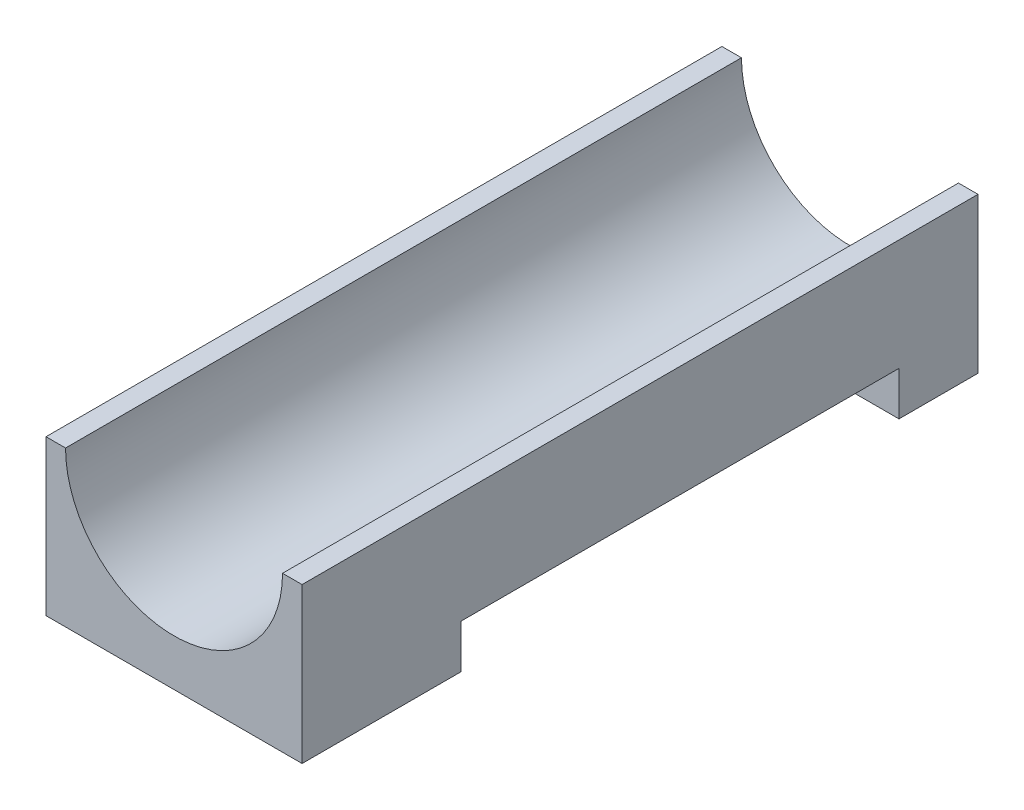
ISO-10303-21;
HEADER;
FILE_DESCRIPTION(('STEP AP214'),'2;1');
FILE_NAME('part.step','',(''),(''),'','','');
FILE_SCHEMA(('AUTOMOTIVE_DESIGN { 1 0 10303 214 1 1 1 1 }'));
ENDSEC;
DATA;
#1=APPLICATION_CONTEXT('core data for automotive mechanical design processes');
#2=APPLICATION_PROTOCOL_DEFINITION('international standard','automotive_design',2000,#1);
#3=PRODUCT_CONTEXT('',#1,'mechanical');
#4=PRODUCT('Part','Part','',(#3));
#5=PRODUCT_RELATED_PRODUCT_CATEGORY('part','',(#4));
#6=PRODUCT_DEFINITION_FORMATION('','',#4);
#7=PRODUCT_DEFINITION_CONTEXT('part definition',#1,'design');
#8=PRODUCT_DEFINITION('design','',#6,#7);
#9=PRODUCT_DEFINITION_SHAPE('','',#8);
#10=(LENGTH_UNIT() NAMED_UNIT(*) SI_UNIT(.MILLI.,.METRE.));
#11=(NAMED_UNIT(*) PLANE_ANGLE_UNIT() SI_UNIT($,.RADIAN.));
#12=(NAMED_UNIT(*) SI_UNIT($,.STERADIAN.) SOLID_ANGLE_UNIT());
#13=UNCERTAINTY_MEASURE_WITH_UNIT(LENGTH_MEASURE(1.E-05),#10,'distance_accuracy_value','');
#14=(GEOMETRIC_REPRESENTATION_CONTEXT(3) GLOBAL_UNCERTAINTY_ASSIGNED_CONTEXT((#13)) GLOBAL_UNIT_ASSIGNED_CONTEXT((#10,
#11,#12)) REPRESENTATION_CONTEXT('',''));
#15=CARTESIAN_POINT('',(0.,0.,0.));
#16=DIRECTION('',(0.,0.,1.));
#17=DIRECTION('',(1.,0.,0.));
#18=AXIS2_PLACEMENT_3D('',#15,#16,#17);
#19=CARTESIAN_POINT('',(0.,23.,100.3));
#20=DIRECTION('',(1.,0.,0.));
#21=DIRECTION('',(0.,1.,0.));
#22=AXIS2_PLACEMENT_3D('',#19,#20,#21);
#23=PLANE('',#22);
#24=DIRECTION('',(0.,1.,0.));
#25=VECTOR('',#24,1.);
#26=CARTESIAN_POINT('',(0.,6.5,11.7250079261373));
#27=LINE('',#26,#25);
#28=CARTESIAN_POINT('',(0.,0.,11.7250079261373));
#29=VERTEX_POINT('',#28);
#30=CARTESIAN_POINT('',(0.,6.5,11.7250079261373));
#31=VERTEX_POINT('',#30);
#32=EDGE_CURVE('E113',#29,#31,#27,.T.);
#33=ORIENTED_EDGE('',*,*,#32,.T.);
#34=DIRECTION('',(0.,0.,1.));
#35=VECTOR('',#34,1.);
#36=CARTESIAN_POINT('',(0.,6.5,76.7250079261373));
#37=LINE('',#36,#35);
#38=CARTESIAN_POINT('',(0.,6.5,76.7250079261373));
#39=VERTEX_POINT('',#38);
#40=EDGE_CURVE('E194',#31,#39,#37,.T.);
#41=ORIENTED_EDGE('',*,*,#40,.T.);
#42=DIRECTION('',(0.,-1.,0.));
#43=VECTOR('',#42,1.);
#44=CARTESIAN_POINT('',(0.,0.,76.7250079261373));
#45=LINE('',#44,#43);
#46=CARTESIAN_POINT('',(0.,0.,76.7250079261373));
#47=VERTEX_POINT('',#46);
#48=EDGE_CURVE('E127',#39,#47,#45,.T.);
#49=ORIENTED_EDGE('',*,*,#48,.T.);
#50=DIRECTION('',(0.,0.,-1.));
#51=VECTOR('',#50,1.);
#52=CARTESIAN_POINT('',(0.,0.,100.3));
#53=LINE('',#52,#51);
#54=CARTESIAN_POINT('',(0.,0.,100.3));
#55=VERTEX_POINT('',#54);
#56=EDGE_CURVE('E40',#55,#47,#53,.T.);
#57=ORIENTED_EDGE('',*,*,#56,.F.);
#58=DIRECTION('',(0.,-1.,0.));
#59=VECTOR('',#58,1.);
#60=CARTESIAN_POINT('',(0.,23.,100.3));
#61=LINE('',#60,#59);
#62=CARTESIAN_POINT('',(0.,23.,100.3));
#63=VERTEX_POINT('',#62);
#64=EDGE_CURVE('E170',#63,#55,#61,.T.);
#65=ORIENTED_EDGE('',*,*,#64,.F.);
#66=DIRECTION('',(0.,0.,-1.));
#67=VECTOR('',#66,1.);
#68=CARTESIAN_POINT('',(0.,23.,100.3));
#69=LINE('',#68,#67);
#70=CARTESIAN_POINT('',(0.,23.,0.));
#71=VERTEX_POINT('',#70);
#72=EDGE_CURVE('E139',#63,#71,#69,.T.);
#73=ORIENTED_EDGE('',*,*,#72,.T.);
#74=DIRECTION('',(0.,-1.,0.));
#75=VECTOR('',#74,1.);
#76=CARTESIAN_POINT('',(0.,23.,0.));
#77=LINE('',#76,#75);
#78=CARTESIAN_POINT('',(0.,0.,0.));
#79=VERTEX_POINT('',#78);
#80=EDGE_CURVE('E152',#71,#79,#77,.T.);
#81=ORIENTED_EDGE('',*,*,#80,.T.);
#82=EDGE_CURVE('E137',#29,#79,#53,.T.);
#83=ORIENTED_EDGE('',*,*,#82,.F.);
#84=EDGE_LOOP('',(#33,#41,#49,#57,#65,#73,#81,#83));
#85=FACE_BOUND('',#84,.T.);
#86=ADVANCED_FACE('F33',(#85),#23,.F.);
#87=CARTESIAN_POINT('',(0.,0.,100.3));
#88=DIRECTION('',(0.,1.,0.));
#89=DIRECTION('',(0.,0.,1.));
#90=AXIS2_PLACEMENT_3D('',#87,#88,#89);
#91=PLANE('',#90);
#92=DIRECTION('',(-1.,0.,0.));
#93=VECTOR('',#92,1.);
#94=CARTESIAN_POINT('',(38.,0.,11.7250079261373));
#95=LINE('',#94,#93);
#96=CARTESIAN_POINT('',(38.,0.,11.7250079261373));
#97=VERTEX_POINT('',#96);
#98=EDGE_CURVE('E107',#97,#29,#95,.T.);
#99=ORIENTED_EDGE('',*,*,#98,.T.);
#100=ORIENTED_EDGE('',*,*,#82,.T.);
#101=DIRECTION('',(1.,0.,0.));
#102=VECTOR('',#101,1.);
#103=CARTESIAN_POINT('',(0.,0.,0.));
#104=LINE('',#103,#102);
#105=CARTESIAN_POINT('',(38.,0.,0.));
#106=VERTEX_POINT('',#105);
#107=EDGE_CURVE('E131',#79,#106,#104,.T.);
#108=ORIENTED_EDGE('',*,*,#107,.T.);
#109=DIRECTION('',(0.,0.,-1.));
#110=VECTOR('',#109,1.);
#111=CARTESIAN_POINT('',(38.,0.,100.3));
#112=LINE('',#111,#110);
#113=EDGE_CURVE('E123',#97,#106,#112,.T.);
#114=ORIENTED_EDGE('',*,*,#113,.F.);
#115=EDGE_LOOP('',(#99,#100,#108,#114));
#116=FACE_BOUND('',#115,.T.);
#117=ADVANCED_FACE('F129',(#116),#91,.F.);
#118=DIRECTION('',(-1.,0.,0.));
#119=VECTOR('',#118,1.);
#120=CARTESIAN_POINT('',(38.,0.,76.7250079261373));
#121=LINE('',#120,#119);
#122=CARTESIAN_POINT('',(38.,0.,76.7250079261373));
#123=VERTEX_POINT('',#122);
#124=EDGE_CURVE('E189',#123,#47,#121,.T.);
#125=ORIENTED_EDGE('',*,*,#124,.F.);
#126=CARTESIAN_POINT('',(38.,0.,100.3));
#127=VERTEX_POINT('',#126);
#128=EDGE_CURVE('E133',#127,#123,#112,.T.);
#129=ORIENTED_EDGE('',*,*,#128,.F.);
#130=DIRECTION('',(1.,0.,0.));
#131=VECTOR('',#130,1.);
#132=CARTESIAN_POINT('',(0.,0.,100.3));
#133=LINE('',#132,#131);
#134=EDGE_CURVE('E179',#55,#127,#133,.T.);
#135=ORIENTED_EDGE('',*,*,#134,.F.);
#136=ORIENTED_EDGE('',*,*,#56,.T.);
#137=EDGE_LOOP('',(#125,#129,#135,#136));
#138=FACE_BOUND('',#137,.T.);
#139=ADVANCED_FACE('F204',(#138),#91,.F.);
#140=CARTESIAN_POINT('',(38.,0.,100.3));
#141=DIRECTION('',(-1.,0.,0.));
#142=DIRECTION('',(0.,0.,1.));
#143=AXIS2_PLACEMENT_3D('',#140,#141,#142);
#144=PLANE('',#143);
#145=DIRECTION('',(0.,1.,0.));
#146=VECTOR('',#145,1.);
#147=CARTESIAN_POINT('',(38.,6.5,11.7250079261373));
#148=LINE('',#147,#146);
#149=CARTESIAN_POINT('',(38.,6.5,11.7250079261373));
#150=VERTEX_POINT('',#149);
#151=EDGE_CURVE('E110',#97,#150,#148,.T.);
#152=ORIENTED_EDGE('',*,*,#151,.F.);
#153=ORIENTED_EDGE('',*,*,#113,.T.);
#154=DIRECTION('',(0.,1.,0.));
#155=VECTOR('',#154,1.);
#156=CARTESIAN_POINT('',(38.,0.,0.));
#157=LINE('',#156,#155);
#158=CARTESIAN_POINT('',(38.,23.,0.));
#159=VERTEX_POINT('',#158);
#160=EDGE_CURVE('E154',#106,#159,#157,.T.);
#161=ORIENTED_EDGE('',*,*,#160,.T.);
#162=DIRECTION('',(0.,0.,-1.));
#163=VECTOR('',#162,1.);
#164=CARTESIAN_POINT('',(38.,23.,100.3));
#165=LINE('',#164,#163);
#166=CARTESIAN_POINT('',(38.,23.,100.3));
#167=VERTEX_POINT('',#166);
#168=EDGE_CURVE('E134',#167,#159,#165,.T.);
#169=ORIENTED_EDGE('',*,*,#168,.F.);
#170=DIRECTION('',(0.,1.,0.));
#171=VECTOR('',#170,1.);
#172=CARTESIAN_POINT('',(38.,0.,100.3));
#173=LINE('',#172,#171);
#174=EDGE_CURVE('E176',#127,#167,#173,.T.);
#175=ORIENTED_EDGE('',*,*,#174,.F.);
#176=ORIENTED_EDGE('',*,*,#128,.T.);
#177=DIRECTION('',(0.,-1.,0.));
#178=VECTOR('',#177,1.);
#179=CARTESIAN_POINT('',(38.,0.,76.7250079261373));
#180=LINE('',#179,#178);
#181=CARTESIAN_POINT('',(38.,6.5,76.7250079261373));
#182=VERTEX_POINT('',#181);
#183=EDGE_CURVE('E191',#182,#123,#180,.T.);
#184=ORIENTED_EDGE('',*,*,#183,.F.);
#185=DIRECTION('',(0.,0.,1.));
#186=VECTOR('',#185,1.);
#187=CARTESIAN_POINT('',(38.,6.5,76.7250079261373));
#188=LINE('',#187,#186);
#189=EDGE_CURVE('E126',#150,#182,#188,.T.);
#190=ORIENTED_EDGE('',*,*,#189,.F.);
#191=EDGE_LOOP('',(#152,#153,#161,#169,#175,#176,#184,#190));
#192=FACE_BOUND('',#191,.T.);
#193=ADVANCED_FACE('F122',(#192),#144,.F.);
#194=CARTESIAN_POINT('',(38.,23.,100.3));
#195=DIRECTION('',(0.,-1.,0.));
#196=DIRECTION('',(1.,0.,0.));
#197=AXIS2_PLACEMENT_3D('',#194,#195,#196);
#198=PLANE('',#197);
#199=DIRECTION('',(0.,0.,-1.));
#200=VECTOR('',#199,1.);
#201=CARTESIAN_POINT('',(2.9,23.,100.3));
#202=LINE('',#201,#200);
#203=CARTESIAN_POINT('',(2.9,23.,0.));
#204=VERTEX_POINT('',#203);
#205=CARTESIAN_POINT('',(2.9,23.,100.3));
#206=VERTEX_POINT('',#205);
#207=EDGE_CURVE('E159',#204,#206,#202,.F.);
#208=ORIENTED_EDGE('',*,*,#207,.F.);
#209=DIRECTION('',(-1.,0.,0.));
#210=VECTOR('',#209,1.);
#211=CARTESIAN_POINT('',(38.,23.,0.));
#212=LINE('',#211,#210);
#213=EDGE_CURVE('E167',#204,#71,#212,.T.);
#214=ORIENTED_EDGE('',*,*,#213,.T.);
#215=ORIENTED_EDGE('',*,*,#72,.F.);
#216=DIRECTION('',(-1.,0.,0.));
#217=VECTOR('',#216,1.);
#218=CARTESIAN_POINT('',(38.,23.,100.3));
#219=LINE('',#218,#217);
#220=EDGE_CURVE('E172',#206,#63,#219,.T.);
#221=ORIENTED_EDGE('',*,*,#220,.F.);
#222=EDGE_LOOP('',(#208,#214,#215,#221));
#223=FACE_BOUND('',#222,.T.);
#224=ADVANCED_FACE('F210',(#223),#198,.F.);
#225=DIRECTION('',(0.,0.,-1.));
#226=VECTOR('',#225,1.);
#227=CARTESIAN_POINT('',(35.1,23.,100.3));
#228=LINE('',#227,#226);
#229=CARTESIAN_POINT('',(35.1,23.,100.3));
#230=VERTEX_POINT('',#229);
#231=CARTESIAN_POINT('',(35.1,23.,0.));
#232=VERTEX_POINT('',#231);
#233=EDGE_CURVE('E54',#230,#232,#228,.T.);
#234=ORIENTED_EDGE('',*,*,#233,.F.);
#235=EDGE_CURVE('E163',#167,#230,#219,.T.);
#236=ORIENTED_EDGE('',*,*,#235,.F.);
#237=ORIENTED_EDGE('',*,*,#168,.T.);
#238=EDGE_CURVE('E168',#159,#232,#212,.T.);
#239=ORIENTED_EDGE('',*,*,#238,.T.);
#240=EDGE_LOOP('',(#234,#236,#237,#239));
#241=FACE_BOUND('',#240,.T.);
#242=ADVANCED_FACE('F206',(#241),#198,.F.);
#243=CARTESIAN_POINT('',(0.,0.,100.3));
#244=DIRECTION('',(0.,0.,1.));
#245=DIRECTION('',(1.,0.,0.));
#246=AXIS2_PLACEMENT_3D('',#243,#244,#245);
#247=PLANE('',#246);
#248=ORIENTED_EDGE('',*,*,#235,.T.);
#249=CARTESIAN_POINT('',(19.,23.,100.3));
#250=DIRECTION('',(0.,0.,1.));
#251=DIRECTION('',(1.,0.,0.));
#252=AXIS2_PLACEMENT_3D('',#249,#250,#251);
#253=CIRCLE('',#252,16.1);
#254=EDGE_CURVE('E117',#206,#230,#253,.T.);
#255=ORIENTED_EDGE('',*,*,#254,.F.);
#256=ORIENTED_EDGE('',*,*,#220,.T.);
#257=ORIENTED_EDGE('',*,*,#64,.T.);
#258=ORIENTED_EDGE('',*,*,#134,.T.);
#259=ORIENTED_EDGE('',*,*,#174,.T.);
#260=EDGE_LOOP('',(#248,#255,#256,#257,#258,#259));
#261=FACE_BOUND('',#260,.T.);
#262=ADVANCED_FACE('F211',(#261),#247,.T.);
#263=CARTESIAN_POINT('',(0.,0.,0.));
#264=DIRECTION('',(0.,0.,1.));
#265=DIRECTION('',(1.,0.,0.));
#266=AXIS2_PLACEMENT_3D('',#263,#264,#265);
#267=PLANE('',#266);
#268=CARTESIAN_POINT('',(19.,23.,0.));
#269=DIRECTION('',(0.,0.,1.));
#270=DIRECTION('',(1.,0.,0.));
#271=AXIS2_PLACEMENT_3D('',#268,#269,#270);
#272=CIRCLE('',#271,16.1);
#273=EDGE_CURVE('E11',#232,#204,#272,.F.);
#274=ORIENTED_EDGE('',*,*,#273,.F.);
#275=ORIENTED_EDGE('',*,*,#238,.F.);
#276=ORIENTED_EDGE('',*,*,#160,.F.);
#277=ORIENTED_EDGE('',*,*,#107,.F.);
#278=ORIENTED_EDGE('',*,*,#80,.F.);
#279=ORIENTED_EDGE('',*,*,#213,.F.);
#280=EDGE_LOOP('',(#274,#275,#276,#277,#278,#279));
#281=FACE_BOUND('',#280,.T.);
#282=ADVANCED_FACE('F150',(#281),#267,.F.);
#283=CARTESIAN_POINT('',(19.,23.,100.3));
#284=DIRECTION('',(0.,0.,-1.));
#285=DIRECTION('',(-1.,0.,0.));
#286=AXIS2_PLACEMENT_3D('',#283,#284,#285);
#287=CYLINDRICAL_SURFACE('',#286,16.1);
#288=ORIENTED_EDGE('',*,*,#207,.T.);
#289=ORIENTED_EDGE('',*,*,#254,.T.);
#290=ORIENTED_EDGE('',*,*,#233,.T.);
#291=ORIENTED_EDGE('',*,*,#273,.T.);
#292=EDGE_LOOP('',(#288,#289,#290,#291));
#293=FACE_BOUND('',#292,.T.);
#294=ADVANCED_FACE('F208',(#293),#287,.F.);
#295=CARTESIAN_POINT('',(38.,6.5,11.7250079261373));
#296=DIRECTION('',(0.,0.,1.));
#297=DIRECTION('',(1.,0.,0.));
#298=AXIS2_PLACEMENT_3D('',#295,#296,#297);
#299=PLANE('',#298);
#300=ORIENTED_EDGE('',*,*,#32,.F.);
#301=ORIENTED_EDGE('',*,*,#98,.F.);
#302=ORIENTED_EDGE('',*,*,#151,.T.);
#303=DIRECTION('',(-1.,0.,0.));
#304=VECTOR('',#303,1.);
#305=CARTESIAN_POINT('',(38.,6.5,11.7250079261373));
#306=LINE('',#305,#304);
#307=EDGE_CURVE('E118',#150,#31,#306,.T.);
#308=ORIENTED_EDGE('',*,*,#307,.T.);
#309=EDGE_LOOP('',(#300,#301,#302,#308));
#310=FACE_BOUND('',#309,.T.);
#311=ADVANCED_FACE('F109',(#310),#299,.T.);
#312=CARTESIAN_POINT('',(38.,6.5,76.7250079261373));
#313=DIRECTION('',(0.,-1.,0.));
#314=DIRECTION('',(0.,0.,-1.));
#315=AXIS2_PLACEMENT_3D('',#312,#313,#314);
#316=PLANE('',#315);
#317=ORIENTED_EDGE('',*,*,#40,.F.);
#318=ORIENTED_EDGE('',*,*,#307,.F.);
#319=ORIENTED_EDGE('',*,*,#189,.T.);
#320=DIRECTION('',(-1.,0.,0.));
#321=VECTOR('',#320,1.);
#322=CARTESIAN_POINT('',(38.,6.5,76.7250079261373));
#323=LINE('',#322,#321);
#324=EDGE_CURVE('E47',#182,#39,#323,.T.);
#325=ORIENTED_EDGE('',*,*,#324,.T.);
#326=EDGE_LOOP('',(#317,#318,#319,#325));
#327=FACE_BOUND('',#326,.T.);
#328=ADVANCED_FACE('F201',(#327),#316,.T.);
#329=CARTESIAN_POINT('',(38.,0.,76.7250079261373));
#330=DIRECTION('',(0.,0.,-1.));
#331=DIRECTION('',(-1.,0.,0.));
#332=AXIS2_PLACEMENT_3D('',#329,#330,#331);
#333=PLANE('',#332);
#334=ORIENTED_EDGE('',*,*,#48,.F.);
#335=ORIENTED_EDGE('',*,*,#324,.F.);
#336=ORIENTED_EDGE('',*,*,#183,.T.);
#337=ORIENTED_EDGE('',*,*,#124,.T.);
#338=EDGE_LOOP('',(#334,#335,#336,#337));
#339=FACE_BOUND('',#338,.T.);
#340=ADVANCED_FACE('F203',(#339),#333,.T.);
#341=CLOSED_SHELL('',(#86,#117,#139,#193,#224,#242,#262,#282,#294,#311,#328,#340));
#342=MANIFOLD_SOLID_BREP('B2',#341);
#343=ADVANCED_BREP_SHAPE_REPRESENTATION('',(#18,#342),#14);
#344=SHAPE_DEFINITION_REPRESENTATION(#9,#343);
ENDSEC;
END-ISO-10303-21;
